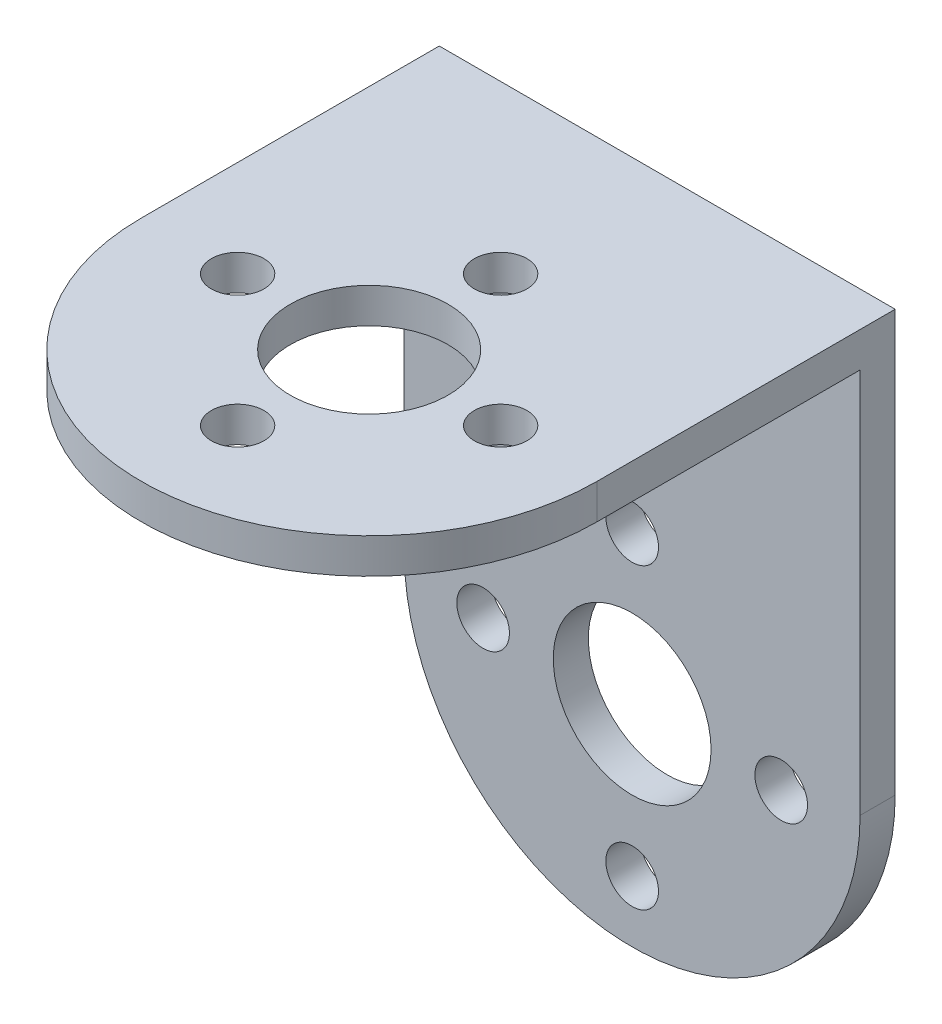
ISO-10303-21;
HEADER;
FILE_DESCRIPTION(('STEP AP214'),'2;1');
FILE_NAME('part.step','',(''),(''),'','','');
FILE_SCHEMA(('AUTOMOTIVE_DESIGN { 1 0 10303 214 1 1 1 1 }'));
ENDSEC;
DATA;
#1=APPLICATION_CONTEXT('core data for automotive mechanical design processes');
#2=APPLICATION_PROTOCOL_DEFINITION('international standard','automotive_design',2000,#1);
#3=PRODUCT_CONTEXT('',#1,'mechanical');
#4=PRODUCT('Part','Part','',(#3));
#5=PRODUCT_RELATED_PRODUCT_CATEGORY('part','',(#4));
#6=PRODUCT_DEFINITION_FORMATION('','',#4);
#7=PRODUCT_DEFINITION_CONTEXT('part definition',#1,'design');
#8=PRODUCT_DEFINITION('design','',#6,#7);
#9=PRODUCT_DEFINITION_SHAPE('','',#8);
#10=(LENGTH_UNIT() NAMED_UNIT(*) SI_UNIT(.MILLI.,.METRE.));
#11=(NAMED_UNIT(*) PLANE_ANGLE_UNIT() SI_UNIT($,.RADIAN.));
#12=(NAMED_UNIT(*) SI_UNIT($,.STERADIAN.) SOLID_ANGLE_UNIT());
#13=UNCERTAINTY_MEASURE_WITH_UNIT(LENGTH_MEASURE(1.E-05),#10,'distance_accuracy_value','');
#14=(GEOMETRIC_REPRESENTATION_CONTEXT(3) GLOBAL_UNCERTAINTY_ASSIGNED_CONTEXT((#13)) GLOBAL_UNIT_ASSIGNED_CONTEXT((#10,
#11,#12)) REPRESENTATION_CONTEXT('',''));
#15=CARTESIAN_POINT('',(0.,0.,0.));
#16=DIRECTION('',(0.,0.,1.));
#17=DIRECTION('',(1.,0.,0.));
#18=AXIS2_PLACEMENT_3D('',#15,#16,#17);
#19=CARTESIAN_POINT('',(26.,-0.999999999999997,-12.5));
#20=DIRECTION('',(0.,1.,0.));
#21=DIRECTION('',(0.,0.,1.));
#22=AXIS2_PLACEMENT_3D('',#19,#20,#21);
#23=PLANE('',#22);
#24=CARTESIAN_POINT('',(13.,-0.999999999999999,10.));
#25=DIRECTION('',(0.,-1.,0.));
#26=DIRECTION('',(0.,0.,-1.));
#27=AXIS2_PLACEMENT_3D('',#24,#25,#26);
#28=CIRCLE('',#27,1.5);
#29=CARTESIAN_POINT('',(13.,-0.999999999999999,8.50000000000001));
#30=VERTEX_POINT('',#29);
#31=EDGE_CURVE('E297',#30,#30,#28,.T.);
#32=ORIENTED_EDGE('',*,*,#31,.F.);
#33=EDGE_LOOP('',(#32));
#34=FACE_BOUND('',#33,.T.);
#35=CARTESIAN_POINT('',(13.,-0.999999999999998,2.5));
#36=DIRECTION('',(0.,-1.,0.));
#37=DIRECTION('',(0.,0.,-1.));
#38=AXIS2_PLACEMENT_3D('',#35,#36,#37);
#39=CIRCLE('',#38,4.5);
#40=CARTESIAN_POINT('',(13.,-0.999999999999998,-2.));
#41=VERTEX_POINT('',#40);
#42=EDGE_CURVE('E383',#41,#41,#39,.T.);
#43=ORIENTED_EDGE('',*,*,#42,.F.);
#44=EDGE_LOOP('',(#43));
#45=FACE_BOUND('',#44,.T.);
#46=CARTESIAN_POINT('',(13.,-0.999999999999997,-5.));
#47=DIRECTION('',(0.,-1.,0.));
#48=DIRECTION('',(0.,0.,-1.));
#49=AXIS2_PLACEMENT_3D('',#46,#47,#48);
#50=CIRCLE('',#49,1.5);
#51=CARTESIAN_POINT('',(13.,-0.999999999999997,-6.49999999999999));
#52=VERTEX_POINT('',#51);
#53=EDGE_CURVE('E376',#52,#52,#50,.T.);
#54=ORIENTED_EDGE('',*,*,#53,.F.);
#55=EDGE_LOOP('',(#54));
#56=FACE_BOUND('',#55,.T.);
#57=CARTESIAN_POINT('',(20.5,-0.999999999999998,2.50000000000001));
#58=DIRECTION('',(0.,-1.,0.));
#59=DIRECTION('',(0.,0.,-1.));
#60=AXIS2_PLACEMENT_3D('',#57,#58,#59);
#61=CIRCLE('',#60,1.5);
#62=CARTESIAN_POINT('',(20.5,-0.999999999999998,1.00000000000001));
#63=VERTEX_POINT('',#62);
#64=EDGE_CURVE('E368',#63,#63,#61,.T.);
#65=ORIENTED_EDGE('',*,*,#64,.F.);
#66=EDGE_LOOP('',(#65));
#67=FACE_BOUND('',#66,.T.);
#68=CARTESIAN_POINT('',(5.5,-0.999999999999998,2.50000000000001));
#69=DIRECTION('',(0.,-1.,0.));
#70=DIRECTION('',(0.,0.,-1.));
#71=AXIS2_PLACEMENT_3D('',#68,#69,#70);
#72=CIRCLE('',#71,1.5);
#73=CARTESIAN_POINT('',(5.5,-0.999999999999998,1.00000000000001));
#74=VERTEX_POINT('',#73);
#75=EDGE_CURVE('E379',#74,#74,#72,.T.);
#76=ORIENTED_EDGE('',*,*,#75,.F.);
#77=EDGE_LOOP('',(#76));
#78=FACE_BOUND('',#77,.T.);
#79=CARTESIAN_POINT('',(13.,-0.999999999999998,2.5));
#80=DIRECTION('',(0.,-1.,0.));
#81=DIRECTION('',(0.,0.,-1.));
#82=AXIS2_PLACEMENT_3D('',#79,#80,#81);
#83=CIRCLE('',#82,13.);
#84=CARTESIAN_POINT('',(26.,-0.999999999999998,2.5));
#85=VERTEX_POINT('',#84);
#86=CARTESIAN_POINT('',(0.,-0.999999999999998,2.5));
#87=VERTEX_POINT('',#86);
#88=EDGE_CURVE('E288',#85,#87,#83,.T.);
#89=ORIENTED_EDGE('',*,*,#88,.T.);
#90=DIRECTION('',(0.,0.,-1.));
#91=VECTOR('',#90,1.);
#92=CARTESIAN_POINT('',(0.,-0.999999999999997,-12.5));
#93=LINE('',#92,#91);
#94=CARTESIAN_POINT('',(0.,-0.999999999999997,-12.5));
#95=VERTEX_POINT('',#94);
#96=EDGE_CURVE('E296',#87,#95,#93,.T.);
#97=ORIENTED_EDGE('',*,*,#96,.T.);
#98=DIRECTION('',(-1.,0.,0.));
#99=VECTOR('',#98,1.);
#100=CARTESIAN_POINT('',(26.,-0.999999999999997,-12.5));
#101=LINE('',#100,#99);
#102=CARTESIAN_POINT('',(26.,-0.999999999999997,-12.5));
#103=VERTEX_POINT('',#102);
#104=EDGE_CURVE('E12',#103,#95,#101,.T.);
#105=ORIENTED_EDGE('',*,*,#104,.F.);
#106=DIRECTION('',(0.,0.,-1.));
#107=VECTOR('',#106,1.);
#108=CARTESIAN_POINT('',(26.,-0.999999999999997,-12.5));
#109=LINE('',#108,#107);
#110=EDGE_CURVE('E302',#85,#103,#109,.T.);
#111=ORIENTED_EDGE('',*,*,#110,.F.);
#112=EDGE_LOOP('',(#89,#97,#105,#111));
#113=FACE_BOUND('',#112,.T.);
#114=ADVANCED_FACE('F229',(#34,#45,#56,#67,#78,#113),#23,.F.);
#115=CARTESIAN_POINT('',(26.,1.,15.5));
#116=DIRECTION('',(0.,-1.,0.));
#117=DIRECTION('',(0.,0.,-1.));
#118=AXIS2_PLACEMENT_3D('',#115,#116,#117);
#119=PLANE('',#118);
#120=CARTESIAN_POINT('',(13.,1.,10.));
#121=DIRECTION('',(0.,-1.,0.));
#122=DIRECTION('',(0.,0.,-1.));
#123=AXIS2_PLACEMENT_3D('',#120,#121,#122);
#124=CIRCLE('',#123,1.5);
#125=CARTESIAN_POINT('',(13.,1.,8.50000000000001));
#126=VERTEX_POINT('',#125);
#127=EDGE_CURVE('E395',#126,#126,#124,.T.);
#128=ORIENTED_EDGE('',*,*,#127,.T.);
#129=EDGE_LOOP('',(#128));
#130=FACE_BOUND('',#129,.T.);
#131=CARTESIAN_POINT('',(13.,1.,2.5));
#132=DIRECTION('',(0.,-1.,0.));
#133=DIRECTION('',(0.,0.,-1.));
#134=AXIS2_PLACEMENT_3D('',#131,#132,#133);
#135=CIRCLE('',#134,4.5);
#136=CARTESIAN_POINT('',(13.,1.,-2.));
#137=VERTEX_POINT('',#136);
#138=EDGE_CURVE('E374',#137,#137,#135,.T.);
#139=ORIENTED_EDGE('',*,*,#138,.T.);
#140=EDGE_LOOP('',(#139));
#141=FACE_BOUND('',#140,.T.);
#142=CARTESIAN_POINT('',(13.,1.,-5.));
#143=DIRECTION('',(0.,-1.,0.));
#144=DIRECTION('',(0.,0.,-1.));
#145=AXIS2_PLACEMENT_3D('',#142,#143,#144);
#146=CIRCLE('',#145,1.5);
#147=CARTESIAN_POINT('',(13.,1.,-6.49999999999999));
#148=VERTEX_POINT('',#147);
#149=EDGE_CURVE('E380',#148,#148,#146,.T.);
#150=ORIENTED_EDGE('',*,*,#149,.T.);
#151=EDGE_LOOP('',(#150));
#152=FACE_BOUND('',#151,.T.);
#153=CARTESIAN_POINT('',(20.5,1.,2.50000000000001));
#154=DIRECTION('',(0.,-1.,0.));
#155=DIRECTION('',(0.,0.,-1.));
#156=AXIS2_PLACEMENT_3D('',#153,#154,#155);
#157=CIRCLE('',#156,1.5);
#158=CARTESIAN_POINT('',(20.5,1.,1.00000000000001));
#159=VERTEX_POINT('',#158);
#160=EDGE_CURVE('E365',#159,#159,#157,.T.);
#161=ORIENTED_EDGE('',*,*,#160,.T.);
#162=EDGE_LOOP('',(#161));
#163=FACE_BOUND('',#162,.T.);
#164=CARTESIAN_POINT('',(5.5,1.,2.50000000000001));
#165=DIRECTION('',(0.,-1.,0.));
#166=DIRECTION('',(0.,0.,-1.));
#167=AXIS2_PLACEMENT_3D('',#164,#165,#166);
#168=CIRCLE('',#167,1.5);
#169=CARTESIAN_POINT('',(5.5,1.,1.00000000000001));
#170=VERTEX_POINT('',#169);
#171=EDGE_CURVE('E388',#170,#170,#168,.T.);
#172=ORIENTED_EDGE('',*,*,#171,.T.);
#173=EDGE_LOOP('',(#172));
#174=FACE_BOUND('',#173,.T.);
#175=DIRECTION('',(0.,0.,1.));
#176=VECTOR('',#175,1.);
#177=CARTESIAN_POINT('',(0.,1.,15.5));
#178=LINE('',#177,#176);
#179=CARTESIAN_POINT('',(0.,1.,-14.5));
#180=VERTEX_POINT('',#179);
#181=CARTESIAN_POINT('',(0.,1.,2.5));
#182=VERTEX_POINT('',#181);
#183=EDGE_CURVE('E294',#180,#182,#178,.T.);
#184=ORIENTED_EDGE('',*,*,#183,.T.);
#185=CARTESIAN_POINT('',(13.,1.,2.5));
#186=DIRECTION('',(0.,-1.,0.));
#187=DIRECTION('',(0.,0.,-1.));
#188=AXIS2_PLACEMENT_3D('',#185,#186,#187);
#189=CIRCLE('',#188,13.);
#190=CARTESIAN_POINT('',(26.,1.,2.5));
#191=VERTEX_POINT('',#190);
#192=EDGE_CURVE('E279',#191,#182,#189,.T.);
#193=ORIENTED_EDGE('',*,*,#192,.F.);
#194=DIRECTION('',(0.,0.,1.));
#195=VECTOR('',#194,1.);
#196=CARTESIAN_POINT('',(26.,1.,15.5));
#197=LINE('',#196,#195);
#198=CARTESIAN_POINT('',(26.,1.,-14.5));
#199=VERTEX_POINT('',#198);
#200=EDGE_CURVE('E310',#199,#191,#197,.T.);
#201=ORIENTED_EDGE('',*,*,#200,.F.);
#202=DIRECTION('',(-1.,0.,0.));
#203=VECTOR('',#202,1.);
#204=CARTESIAN_POINT('',(26.,1.,-14.5));
#205=LINE('',#204,#203);
#206=EDGE_CURVE('E236',#199,#180,#205,.T.);
#207=ORIENTED_EDGE('',*,*,#206,.T.);
#208=EDGE_LOOP('',(#184,#193,#201,#207));
#209=FACE_BOUND('',#208,.T.);
#210=ADVANCED_FACE('F300',(#130,#141,#152,#163,#174,#209),#119,.F.);
#211=CARTESIAN_POINT('',(26.,-36.,-12.5));
#212=DIRECTION('',(0.,0.,-1.));
#213=DIRECTION('',(0.,1.,0.));
#214=AXIS2_PLACEMENT_3D('',#211,#212,#213);
#215=PLANE('',#214);
#216=CARTESIAN_POINT('',(13.,-24.,-12.5));
#217=DIRECTION('',(0.,0.,1.));
#218=DIRECTION('',(1.,0.,0.));
#219=AXIS2_PLACEMENT_3D('',#216,#217,#218);
#220=CIRCLE('',#219,4.5);
#221=CARTESIAN_POINT('',(17.5,-24.,-12.5));
#222=VERTEX_POINT('',#221);
#223=EDGE_CURVE('E346',#222,#222,#220,.T.);
#224=ORIENTED_EDGE('',*,*,#223,.F.);
#225=EDGE_LOOP('',(#224));
#226=FACE_BOUND('',#225,.T.);
#227=CARTESIAN_POINT('',(4.5,-24.,-12.5));
#228=DIRECTION('',(0.,0.,1.));
#229=DIRECTION('',(1.,0.,0.));
#230=AXIS2_PLACEMENT_3D('',#227,#228,#229);
#231=CIRCLE('',#230,1.5);
#232=CARTESIAN_POINT('',(6.,-24.,-12.5));
#233=VERTEX_POINT('',#232);
#234=EDGE_CURVE('E347',#233,#233,#231,.T.);
#235=ORIENTED_EDGE('',*,*,#234,.F.);
#236=EDGE_LOOP('',(#235));
#237=FACE_BOUND('',#236,.T.);
#238=CARTESIAN_POINT('',(13.,-32.5,-12.5));
#239=DIRECTION('',(0.,0.,1.));
#240=DIRECTION('',(1.,0.,0.));
#241=AXIS2_PLACEMENT_3D('',#238,#239,#240);
#242=CIRCLE('',#241,1.50000000000003);
#243=CARTESIAN_POINT('',(14.5,-32.5,-12.5));
#244=VERTEX_POINT('',#243);
#245=EDGE_CURVE('E337',#244,#244,#242,.T.);
#246=ORIENTED_EDGE('',*,*,#245,.F.);
#247=EDGE_LOOP('',(#246));
#248=FACE_BOUND('',#247,.T.);
#249=CARTESIAN_POINT('',(21.5,-24.,-12.5));
#250=DIRECTION('',(0.,0.,1.));
#251=DIRECTION('',(1.,0.,0.));
#252=AXIS2_PLACEMENT_3D('',#249,#250,#251);
#253=CIRCLE('',#252,1.5);
#254=CARTESIAN_POINT('',(23.,-24.,-12.5));
#255=VERTEX_POINT('',#254);
#256=EDGE_CURVE('E338',#255,#255,#253,.T.);
#257=ORIENTED_EDGE('',*,*,#256,.F.);
#258=EDGE_LOOP('',(#257));
#259=FACE_BOUND('',#258,.T.);
#260=CARTESIAN_POINT('',(13.,-15.5,-12.5));
#261=DIRECTION('',(0.,0.,1.));
#262=DIRECTION('',(1.,0.,0.));
#263=AXIS2_PLACEMENT_3D('',#260,#261,#262);
#264=CIRCLE('',#263,1.50000000000001);
#265=CARTESIAN_POINT('',(14.5,-15.5,-12.5));
#266=VERTEX_POINT('',#265);
#267=EDGE_CURVE('E325',#266,#266,#264,.T.);
#268=ORIENTED_EDGE('',*,*,#267,.F.);
#269=EDGE_LOOP('',(#268));
#270=FACE_BOUND('',#269,.T.);
#271=CARTESIAN_POINT('',(13.,-23.,-12.5));
#272=DIRECTION('',(0.,0.,1.));
#273=DIRECTION('',(1.,0.,0.));
#274=AXIS2_PLACEMENT_3D('',#271,#272,#273);
#275=CIRCLE('',#274,13.);
#276=CARTESIAN_POINT('',(0.,-23.,-12.5));
#277=VERTEX_POINT('',#276);
#278=CARTESIAN_POINT('',(26.,-23.,-12.5));
#279=VERTEX_POINT('',#278);
#280=EDGE_CURVE('E251',#277,#279,#275,.T.);
#281=ORIENTED_EDGE('',*,*,#280,.T.);
#282=DIRECTION('',(0.,-1.,0.));
#283=VECTOR('',#282,1.);
#284=CARTESIAN_POINT('',(26.,-36.,-12.5));
#285=LINE('',#284,#283);
#286=EDGE_CURVE('E305',#103,#279,#285,.T.);
#287=ORIENTED_EDGE('',*,*,#286,.F.);
#288=ORIENTED_EDGE('',*,*,#104,.T.);
#289=DIRECTION('',(0.,-1.,0.));
#290=VECTOR('',#289,1.);
#291=CARTESIAN_POINT('',(0.,-36.,-12.5));
#292=LINE('',#291,#290);
#293=EDGE_CURVE('E307',#95,#277,#292,.T.);
#294=ORIENTED_EDGE('',*,*,#293,.T.);
#295=EDGE_LOOP('',(#281,#287,#288,#294));
#296=FACE_BOUND('',#295,.T.);
#297=ADVANCED_FACE('F320',(#226,#237,#248,#259,#270,#296),#215,.F.);
#298=CARTESIAN_POINT('',(26.,1.,-14.5));
#299=DIRECTION('',(0.,0.,1.));
#300=DIRECTION('',(0.,-1.,0.));
#301=AXIS2_PLACEMENT_3D('',#298,#299,#300);
#302=PLANE('',#301);
#303=CARTESIAN_POINT('',(13.,-24.,-14.5));
#304=DIRECTION('',(0.,0.,1.));
#305=DIRECTION('',(1.,0.,0.));
#306=AXIS2_PLACEMENT_3D('',#303,#304,#305);
#307=CIRCLE('',#306,4.5);
#308=CARTESIAN_POINT('',(17.5,-24.,-14.5));
#309=VERTEX_POINT('',#308);
#310=EDGE_CURVE('E317',#309,#309,#307,.T.);
#311=ORIENTED_EDGE('',*,*,#310,.T.);
#312=EDGE_LOOP('',(#311));
#313=FACE_BOUND('',#312,.T.);
#314=CARTESIAN_POINT('',(4.5,-24.,-14.5));
#315=DIRECTION('',(0.,0.,1.));
#316=DIRECTION('',(1.,0.,0.));
#317=AXIS2_PLACEMENT_3D('',#314,#315,#316);
#318=CIRCLE('',#317,1.5);
#319=CARTESIAN_POINT('',(6.,-24.,-14.5));
#320=VERTEX_POINT('',#319);
#321=EDGE_CURVE('E343',#320,#320,#318,.T.);
#322=ORIENTED_EDGE('',*,*,#321,.T.);
#323=EDGE_LOOP('',(#322));
#324=FACE_BOUND('',#323,.T.);
#325=CARTESIAN_POINT('',(13.,-32.5,-14.5));
#326=DIRECTION('',(0.,0.,1.));
#327=DIRECTION('',(1.,0.,0.));
#328=AXIS2_PLACEMENT_3D('',#325,#326,#327);
#329=CIRCLE('',#328,1.50000000000003);
#330=CARTESIAN_POINT('',(14.5,-32.5,-14.5));
#331=VERTEX_POINT('',#330);
#332=EDGE_CURVE('E350',#331,#331,#329,.T.);
#333=ORIENTED_EDGE('',*,*,#332,.T.);
#334=EDGE_LOOP('',(#333));
#335=FACE_BOUND('',#334,.T.);
#336=CARTESIAN_POINT('',(21.5,-24.,-14.5));
#337=DIRECTION('',(0.,0.,1.));
#338=DIRECTION('',(1.,0.,0.));
#339=AXIS2_PLACEMENT_3D('',#336,#337,#338);
#340=CIRCLE('',#339,1.5);
#341=CARTESIAN_POINT('',(23.,-24.,-14.5));
#342=VERTEX_POINT('',#341);
#343=EDGE_CURVE('E334',#342,#342,#340,.T.);
#344=ORIENTED_EDGE('',*,*,#343,.T.);
#345=EDGE_LOOP('',(#344));
#346=FACE_BOUND('',#345,.T.);
#347=CARTESIAN_POINT('',(13.,-15.5,-14.5));
#348=DIRECTION('',(0.,0.,1.));
#349=DIRECTION('',(1.,0.,0.));
#350=AXIS2_PLACEMENT_3D('',#347,#348,#349);
#351=CIRCLE('',#350,1.50000000000001);
#352=CARTESIAN_POINT('',(14.5,-15.5,-14.5));
#353=VERTEX_POINT('',#352);
#354=EDGE_CURVE('E329',#353,#353,#351,.T.);
#355=ORIENTED_EDGE('',*,*,#354,.T.);
#356=EDGE_LOOP('',(#355));
#357=FACE_BOUND('',#356,.T.);
#358=DIRECTION('',(0.,1.,0.));
#359=VECTOR('',#358,1.);
#360=CARTESIAN_POINT('',(26.,1.,-14.5));
#361=LINE('',#360,#359);
#362=CARTESIAN_POINT('',(26.,-23.,-14.5));
#363=VERTEX_POINT('',#362);
#364=EDGE_CURVE('E311',#363,#199,#361,.T.);
#365=ORIENTED_EDGE('',*,*,#364,.F.);
#366=CARTESIAN_POINT('',(13.,-23.,-14.5));
#367=DIRECTION('',(0.,0.,1.));
#368=DIRECTION('',(1.,0.,0.));
#369=AXIS2_PLACEMENT_3D('',#366,#367,#368);
#370=CIRCLE('',#369,13.);
#371=CARTESIAN_POINT('',(0.,-23.,-14.5));
#372=VERTEX_POINT('',#371);
#373=EDGE_CURVE('E326',#372,#363,#370,.T.);
#374=ORIENTED_EDGE('',*,*,#373,.F.);
#375=DIRECTION('',(0.,1.,0.));
#376=VECTOR('',#375,1.);
#377=CARTESIAN_POINT('',(0.,1.,-14.5));
#378=LINE('',#377,#376);
#379=EDGE_CURVE('E303',#372,#180,#378,.T.);
#380=ORIENTED_EDGE('',*,*,#379,.T.);
#381=ORIENTED_EDGE('',*,*,#206,.F.);
#382=EDGE_LOOP('',(#365,#374,#380,#381));
#383=FACE_BOUND('',#382,.T.);
#384=ADVANCED_FACE('F462',(#313,#324,#335,#346,#357,#383),#302,.F.);
#385=CARTESIAN_POINT('',(26.,0.,0.));
#386=DIRECTION('',(-1.,0.,0.));
#387=DIRECTION('',(0.,0.,1.));
#388=AXIS2_PLACEMENT_3D('',#385,#386,#387);
#389=PLANE('',#388);
#390=ORIENTED_EDGE('',*,*,#200,.T.);
#391=DIRECTION('',(0.,-1.,0.));
#392=VECTOR('',#391,1.);
#393=CARTESIAN_POINT('',(26.,1.,2.5));
#394=LINE('',#393,#392);
#395=EDGE_CURVE('E243',#191,#85,#394,.T.);
#396=ORIENTED_EDGE('',*,*,#395,.T.);
#397=ORIENTED_EDGE('',*,*,#110,.T.);
#398=ORIENTED_EDGE('',*,*,#286,.T.);
#399=DIRECTION('',(0.,0.,1.));
#400=VECTOR('',#399,1.);
#401=CARTESIAN_POINT('',(26.,-23.,-14.5));
#402=LINE('',#401,#400);
#403=EDGE_CURVE('E361',#363,#279,#402,.T.);
#404=ORIENTED_EDGE('',*,*,#403,.F.);
#405=ORIENTED_EDGE('',*,*,#364,.T.);
#406=EDGE_LOOP('',(#390,#396,#397,#398,#404,#405));
#407=FACE_BOUND('',#406,.T.);
#408=ADVANCED_FACE('F360',(#407),#389,.F.);
#409=CARTESIAN_POINT('',(0.,0.,0.));
#410=DIRECTION('',(-1.,0.,0.));
#411=DIRECTION('',(0.,0.,1.));
#412=AXIS2_PLACEMENT_3D('',#409,#410,#411);
#413=PLANE('',#412);
#414=DIRECTION('',(0.,-1.,0.));
#415=VECTOR('',#414,1.);
#416=CARTESIAN_POINT('',(0.,1.,2.5));
#417=LINE('',#416,#415);
#418=EDGE_CURVE('E282',#182,#87,#417,.T.);
#419=ORIENTED_EDGE('',*,*,#418,.F.);
#420=ORIENTED_EDGE('',*,*,#183,.F.);
#421=ORIENTED_EDGE('',*,*,#379,.F.);
#422=DIRECTION('',(0.,0.,1.));
#423=VECTOR('',#422,1.);
#424=CARTESIAN_POINT('',(0.,-23.,-14.5));
#425=LINE('',#424,#423);
#426=EDGE_CURVE('E323',#372,#277,#425,.T.);
#427=ORIENTED_EDGE('',*,*,#426,.T.);
#428=ORIENTED_EDGE('',*,*,#293,.F.);
#429=ORIENTED_EDGE('',*,*,#96,.F.);
#430=EDGE_LOOP('',(#419,#420,#421,#427,#428,#429));
#431=FACE_BOUND('',#430,.T.);
#432=ADVANCED_FACE('F292',(#431),#413,.T.);
#433=CARTESIAN_POINT('',(13.,-23.,-14.5));
#434=DIRECTION('',(0.,0.,1.));
#435=DIRECTION('',(1.,0.,0.));
#436=AXIS2_PLACEMENT_3D('',#433,#434,#435);
#437=CYLINDRICAL_SURFACE('',#436,13.);
#438=ORIENTED_EDGE('',*,*,#280,.F.);
#439=ORIENTED_EDGE('',*,*,#426,.F.);
#440=ORIENTED_EDGE('',*,*,#373,.T.);
#441=ORIENTED_EDGE('',*,*,#403,.T.);
#442=EDGE_LOOP('',(#438,#439,#440,#441));
#443=FACE_BOUND('',#442,.T.);
#444=ADVANCED_FACE('F438',(#443),#437,.T.);
#445=CARTESIAN_POINT('',(13.,-24.,-14.5));
#446=DIRECTION('',(0.,0.,1.));
#447=DIRECTION('',(1.,0.,0.));
#448=AXIS2_PLACEMENT_3D('',#445,#446,#447);
#449=CYLINDRICAL_SURFACE('',#448,4.5);
#450=ORIENTED_EDGE('',*,*,#310,.F.);
#451=EDGE_LOOP('',(#450));
#452=FACE_BOUND('',#451,.T.);
#453=ORIENTED_EDGE('',*,*,#223,.T.);
#454=EDGE_LOOP('',(#453));
#455=FACE_BOUND('',#454,.T.);
#456=ADVANCED_FACE('F441',(#452,#455),#449,.F.);
#457=CARTESIAN_POINT('',(4.5,-24.,-14.5));
#458=DIRECTION('',(0.,0.,1.));
#459=DIRECTION('',(1.,0.,0.));
#460=AXIS2_PLACEMENT_3D('',#457,#458,#459);
#461=CYLINDRICAL_SURFACE('',#460,1.5);
#462=ORIENTED_EDGE('',*,*,#321,.F.);
#463=EDGE_LOOP('',(#462));
#464=FACE_BOUND('',#463,.T.);
#465=ORIENTED_EDGE('',*,*,#234,.T.);
#466=EDGE_LOOP('',(#465));
#467=FACE_BOUND('',#466,.T.);
#468=ADVANCED_FACE('F450',(#464,#467),#461,.F.);
#469=CARTESIAN_POINT('',(13.,-32.5,-14.5));
#470=DIRECTION('',(0.,0.,1.));
#471=DIRECTION('',(1.,0.,0.));
#472=AXIS2_PLACEMENT_3D('',#469,#470,#471);
#473=CYLINDRICAL_SURFACE('',#472,1.50000000000003);
#474=ORIENTED_EDGE('',*,*,#332,.F.);
#475=EDGE_LOOP('',(#474));
#476=FACE_BOUND('',#475,.T.);
#477=ORIENTED_EDGE('',*,*,#245,.T.);
#478=EDGE_LOOP('',(#477));
#479=FACE_BOUND('',#478,.T.);
#480=ADVANCED_FACE('F445',(#476,#479),#473,.F.);
#481=CARTESIAN_POINT('',(21.5,-24.,-14.5));
#482=DIRECTION('',(0.,0.,1.));
#483=DIRECTION('',(1.,0.,0.));
#484=AXIS2_PLACEMENT_3D('',#481,#482,#483);
#485=CYLINDRICAL_SURFACE('',#484,1.5);
#486=ORIENTED_EDGE('',*,*,#343,.F.);
#487=EDGE_LOOP('',(#486));
#488=FACE_BOUND('',#487,.T.);
#489=ORIENTED_EDGE('',*,*,#256,.T.);
#490=EDGE_LOOP('',(#489));
#491=FACE_BOUND('',#490,.T.);
#492=ADVANCED_FACE('F442',(#488,#491),#485,.F.);
#493=CARTESIAN_POINT('',(13.,-15.5,-14.5));
#494=DIRECTION('',(0.,0.,1.));
#495=DIRECTION('',(1.,0.,0.));
#496=AXIS2_PLACEMENT_3D('',#493,#494,#495);
#497=CYLINDRICAL_SURFACE('',#496,1.50000000000001);
#498=ORIENTED_EDGE('',*,*,#354,.F.);
#499=EDGE_LOOP('',(#498));
#500=FACE_BOUND('',#499,.T.);
#501=ORIENTED_EDGE('',*,*,#267,.T.);
#502=EDGE_LOOP('',(#501));
#503=FACE_BOUND('',#502,.T.);
#504=ADVANCED_FACE('F433',(#500,#503),#497,.F.);
#505=CARTESIAN_POINT('',(13.,1.,-5.));
#506=DIRECTION('',(0.,-1.,0.));
#507=DIRECTION('',(0.,0.,-1.));
#508=AXIS2_PLACEMENT_3D('',#505,#506,#507);
#509=CYLINDRICAL_SURFACE('',#508,1.5);
#510=ORIENTED_EDGE('',*,*,#149,.F.);
#511=EDGE_LOOP('',(#510));
#512=FACE_BOUND('',#511,.T.);
#513=ORIENTED_EDGE('',*,*,#53,.T.);
#514=EDGE_LOOP('',(#513));
#515=FACE_BOUND('',#514,.T.);
#516=ADVANCED_FACE('F430',(#512,#515),#509,.F.);
#517=CARTESIAN_POINT('',(13.,1.,2.5));
#518=DIRECTION('',(0.,-1.,0.));
#519=DIRECTION('',(0.,0.,-1.));
#520=AXIS2_PLACEMENT_3D('',#517,#518,#519);
#521=CYLINDRICAL_SURFACE('',#520,4.5);
#522=ORIENTED_EDGE('',*,*,#138,.F.);
#523=EDGE_LOOP('',(#522));
#524=FACE_BOUND('',#523,.T.);
#525=ORIENTED_EDGE('',*,*,#42,.T.);
#526=EDGE_LOOP('',(#525));
#527=FACE_BOUND('',#526,.T.);
#528=ADVANCED_FACE('F428',(#524,#527),#521,.F.);
#529=CARTESIAN_POINT('',(13.,1.,2.5));
#530=DIRECTION('',(0.,-1.,0.));
#531=DIRECTION('',(0.,0.,-1.));
#532=AXIS2_PLACEMENT_3D('',#529,#530,#531);
#533=CYLINDRICAL_SURFACE('',#532,13.);
#534=ORIENTED_EDGE('',*,*,#88,.F.);
#535=ORIENTED_EDGE('',*,*,#395,.F.);
#536=ORIENTED_EDGE('',*,*,#192,.T.);
#537=ORIENTED_EDGE('',*,*,#418,.T.);
#538=EDGE_LOOP('',(#534,#535,#536,#537));
#539=FACE_BOUND('',#538,.T.);
#540=ADVANCED_FACE('F281',(#539),#533,.T.);
#541=CARTESIAN_POINT('',(20.5,1.,2.50000000000001));
#542=DIRECTION('',(0.,-1.,0.));
#543=DIRECTION('',(0.,0.,-1.));
#544=AXIS2_PLACEMENT_3D('',#541,#542,#543);
#545=CYLINDRICAL_SURFACE('',#544,1.5);
#546=ORIENTED_EDGE('',*,*,#160,.F.);
#547=EDGE_LOOP('',(#546));
#548=FACE_BOUND('',#547,.T.);
#549=ORIENTED_EDGE('',*,*,#64,.T.);
#550=EDGE_LOOP('',(#549));
#551=FACE_BOUND('',#550,.T.);
#552=ADVANCED_FACE('F415',(#548,#551),#545,.F.);
#553=CARTESIAN_POINT('',(5.5,1.,2.50000000000001));
#554=DIRECTION('',(0.,-1.,0.));
#555=DIRECTION('',(0.,0.,-1.));
#556=AXIS2_PLACEMENT_3D('',#553,#554,#555);
#557=CYLINDRICAL_SURFACE('',#556,1.5);
#558=ORIENTED_EDGE('',*,*,#171,.F.);
#559=EDGE_LOOP('',(#558));
#560=FACE_BOUND('',#559,.T.);
#561=ORIENTED_EDGE('',*,*,#75,.T.);
#562=EDGE_LOOP('',(#561));
#563=FACE_BOUND('',#562,.T.);
#564=ADVANCED_FACE('F413',(#560,#563),#557,.F.);
#565=CARTESIAN_POINT('',(13.,1.,10.));
#566=DIRECTION('',(0.,-1.,0.));
#567=DIRECTION('',(0.,0.,-1.));
#568=AXIS2_PLACEMENT_3D('',#565,#566,#567);
#569=CYLINDRICAL_SURFACE('',#568,1.5);
#570=ORIENTED_EDGE('',*,*,#127,.F.);
#571=EDGE_LOOP('',(#570));
#572=FACE_BOUND('',#571,.T.);
#573=ORIENTED_EDGE('',*,*,#31,.T.);
#574=EDGE_LOOP('',(#573));
#575=FACE_BOUND('',#574,.T.);
#576=ADVANCED_FACE('F401',(#572,#575),#569,.F.);
#577=CLOSED_SHELL('',(#114,#210,#297,#384,#408,#432,#444,#456,#468,#480,#492,#504,#516,#528,
#540,#552,#564,#576));
#578=MANIFOLD_SOLID_BREP('B2',#577);
#579=ADVANCED_BREP_SHAPE_REPRESENTATION('',(#18,#578),#14);
#580=SHAPE_DEFINITION_REPRESENTATION(#9,#579);
ENDSEC;
END-ISO-10303-21;
